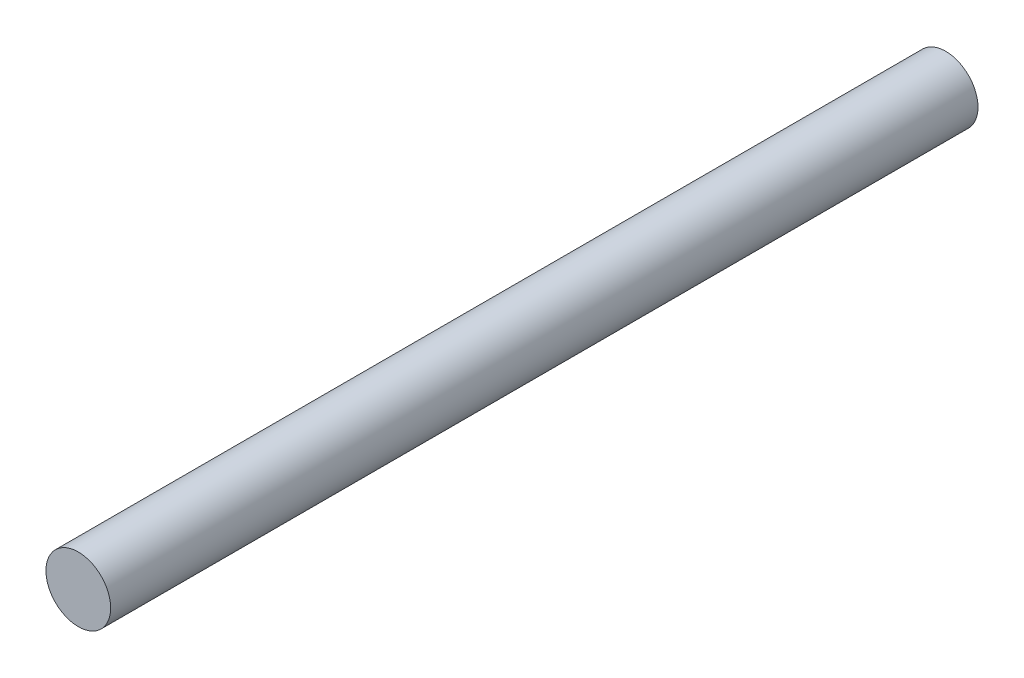
ISO-10303-21;
HEADER;
FILE_DESCRIPTION(('STEP AP214'),'2;1');
FILE_NAME('part.step','',(''),(''),'','','');
FILE_SCHEMA(('AUTOMOTIVE_DESIGN { 1 0 10303 214 1 1 1 1 }'));
ENDSEC;
DATA;
#1=APPLICATION_CONTEXT('core data for automotive mechanical design processes');
#2=APPLICATION_PROTOCOL_DEFINITION('international standard','automotive_design',2000,#1);
#3=PRODUCT_CONTEXT('',#1,'mechanical');
#4=PRODUCT('Part','Part','',(#3));
#5=PRODUCT_RELATED_PRODUCT_CATEGORY('part','',(#4));
#6=PRODUCT_DEFINITION_FORMATION('','',#4);
#7=PRODUCT_DEFINITION_CONTEXT('part definition',#1,'design');
#8=PRODUCT_DEFINITION('design','',#6,#7);
#9=PRODUCT_DEFINITION_SHAPE('','',#8);
#10=(LENGTH_UNIT() NAMED_UNIT(*) SI_UNIT(.MILLI.,.METRE.));
#11=(NAMED_UNIT(*) PLANE_ANGLE_UNIT() SI_UNIT($,.RADIAN.));
#12=(NAMED_UNIT(*) SI_UNIT($,.STERADIAN.) SOLID_ANGLE_UNIT());
#13=UNCERTAINTY_MEASURE_WITH_UNIT(LENGTH_MEASURE(1.E-05),#10,'distance_accuracy_value','');
#14=(GEOMETRIC_REPRESENTATION_CONTEXT(3) GLOBAL_UNCERTAINTY_ASSIGNED_CONTEXT((#13)) GLOBAL_UNIT_ASSIGNED_CONTEXT((#10,
#11,#12)) REPRESENTATION_CONTEXT('',''));
#15=CARTESIAN_POINT('',(0.,0.,0.));
#16=DIRECTION('',(0.,0.,1.));
#17=DIRECTION('',(1.,0.,0.));
#18=AXIS2_PLACEMENT_3D('',#15,#16,#17);
#19=CARTESIAN_POINT('',(0.,0.,85.09));
#20=DIRECTION('',(0.,0.,-1.));
#21=DIRECTION('',(-1.,0.,0.));
#22=AXIS2_PLACEMENT_3D('',#19,#20,#21);
#23=CYLINDRICAL_SURFACE('',#22,3.175);
#24=CARTESIAN_POINT('',(0.,0.,85.09));
#25=DIRECTION('',(0.,0.,1.));
#26=DIRECTION('',(1.,0.,0.));
#27=AXIS2_PLACEMENT_3D('',#24,#25,#26);
#28=CIRCLE('',#27,3.175);
#29=CARTESIAN_POINT('',(3.175,0.,85.09));
#30=VERTEX_POINT('',#29);
#31=EDGE_CURVE('E10',#30,#30,#28,.T.);
#32=ORIENTED_EDGE('',*,*,#31,.F.);
#33=EDGE_LOOP('',(#32));
#34=FACE_BOUND('',#33,.T.);
#35=CARTESIAN_POINT('',(0.,0.,0.));
#36=DIRECTION('',(0.,0.,1.));
#37=DIRECTION('',(1.,0.,0.));
#38=AXIS2_PLACEMENT_3D('',#35,#36,#37);
#39=CIRCLE('',#38,3.175);
#40=CARTESIAN_POINT('',(3.175,0.,0.));
#41=VERTEX_POINT('',#40);
#42=EDGE_CURVE('E37',#41,#41,#39,.T.);
#43=ORIENTED_EDGE('',*,*,#42,.T.);
#44=EDGE_LOOP('',(#43));
#45=FACE_BOUND('',#44,.T.);
#46=ADVANCED_FACE('F34',(#34,#45),#23,.T.);
#47=CARTESIAN_POINT('',(0.,0.,85.09));
#48=DIRECTION('',(0.,0.,1.));
#49=DIRECTION('',(1.,0.,0.));
#50=AXIS2_PLACEMENT_3D('',#47,#48,#49);
#51=PLANE('',#50);
#52=ORIENTED_EDGE('',*,*,#31,.T.);
#53=EDGE_LOOP('',(#52));
#54=FACE_BOUND('',#53,.T.);
#55=ADVANCED_FACE('F49',(#54),#51,.T.);
#56=CARTESIAN_POINT('',(0.,0.,0.));
#57=DIRECTION('',(0.,0.,1.));
#58=DIRECTION('',(1.,0.,0.));
#59=AXIS2_PLACEMENT_3D('',#56,#57,#58);
#60=PLANE('',#59);
#61=ORIENTED_EDGE('',*,*,#42,.F.);
#62=EDGE_LOOP('',(#61));
#63=FACE_BOUND('',#62,.T.);
#64=ADVANCED_FACE('F47',(#63),#60,.F.);
#65=CLOSED_SHELL('',(#46,#55,#64));
#66=MANIFOLD_SOLID_BREP('B2',#65);
#67=ADVANCED_BREP_SHAPE_REPRESENTATION('',(#18,#66),#14);
#68=SHAPE_DEFINITION_REPRESENTATION(#9,#67);
ENDSEC;
END-ISO-10303-21;
